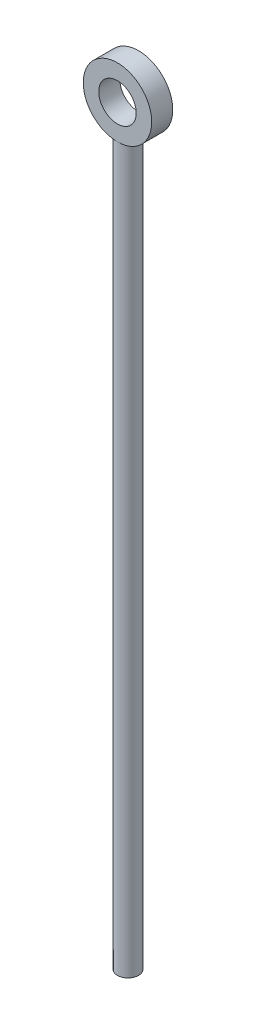
ISO-10303-21;
HEADER;
FILE_DESCRIPTION(('STEP AP214'),'2;1');
FILE_NAME('part.step','',(''),(''),'','','');
FILE_SCHEMA(('AUTOMOTIVE_DESIGN { 1 0 10303 214 1 1 1 1 }'));
ENDSEC;
DATA;
#1=APPLICATION_CONTEXT('core data for automotive mechanical design processes');
#2=APPLICATION_PROTOCOL_DEFINITION('international standard','automotive_design',2000,#1);
#3=PRODUCT_CONTEXT('',#1,'mechanical');
#4=PRODUCT('Part','Part','',(#3));
#5=PRODUCT_RELATED_PRODUCT_CATEGORY('part','',(#4));
#6=PRODUCT_DEFINITION_FORMATION('','',#4);
#7=PRODUCT_DEFINITION_CONTEXT('part definition',#1,'design');
#8=PRODUCT_DEFINITION('design','',#6,#7);
#9=PRODUCT_DEFINITION_SHAPE('','',#8);
#10=(LENGTH_UNIT() NAMED_UNIT(*) SI_UNIT(.MILLI.,.METRE.));
#11=(NAMED_UNIT(*) PLANE_ANGLE_UNIT() SI_UNIT($,.RADIAN.));
#12=(NAMED_UNIT(*) SI_UNIT($,.STERADIAN.) SOLID_ANGLE_UNIT());
#13=UNCERTAINTY_MEASURE_WITH_UNIT(LENGTH_MEASURE(1.E-05),#10,'distance_accuracy_value','');
#14=(GEOMETRIC_REPRESENTATION_CONTEXT(3) GLOBAL_UNCERTAINTY_ASSIGNED_CONTEXT((#13)) GLOBAL_UNIT_ASSIGNED_CONTEXT((#10,
#11,#12)) REPRESENTATION_CONTEXT('',''));
#15=CARTESIAN_POINT('',(0.,0.,0.));
#16=DIRECTION('',(0.,0.,1.));
#17=DIRECTION('',(1.,0.,0.));
#18=AXIS2_PLACEMENT_3D('',#15,#16,#17);
#19=CARTESIAN_POINT('',(0.,35.889766172627,0.5));
#20=DIRECTION('',(0.,0.,-1.));
#21=DIRECTION('',(-1.,0.,0.));
#22=AXIS2_PLACEMENT_3D('',#19,#20,#21);
#23=CYLINDRICAL_SURFACE('',#22,1.62420373642367);
#24=CARTESIAN_POINT('',(0.,35.889766172627,-0.5));
#25=DIRECTION('',(0.,0.,1.));
#26=DIRECTION('',(1.,0.,0.));
#27=AXIS2_PLACEMENT_3D('',#24,#25,#26);
#28=CIRCLE('',#27,1.62420373642367);
#29=CARTESIAN_POINT('',(0.,34.2655624362033,-0.5));
#30=VERTEX_POINT('',#29);
#31=EDGE_CURVE('E58',#30,#30,#28,.T.);
#32=ORIENTED_EDGE('',*,*,#31,.T.);
#33=CARTESIAN_POINT('',(0.,34.2655624362033,-0.5));
#34=CARTESIAN_POINT('',(-0.0273959650569291,34.2655626120081,-0.499999761655353));
#35=CARTESIAN_POINT('',(-0.0547943665766206,34.2662621552462,-0.49774094632123));
#36=CARTESIAN_POINT('',(-0.108791195346571,34.2689843095631,-0.488788203846725));
#37=CARTESIAN_POINT('',(-0.135389418168901,34.2710072557895,-0.482093153238379));
#38=CARTESIAN_POINT('',(-0.18699937598438,34.2761549722287,-0.464514192274198));
#39=CARTESIAN_POINT('',(-0.212013456476829,34.2792780663136,-0.453636651846705));
#40=CARTESIAN_POINT('',(-0.259862647884071,34.2863028088528,-0.428028217729409));
#41=CARTESIAN_POINT('',(-0.282697434582413,34.2902045728848,-0.413296751901816));
#42=CARTESIAN_POINT('',(-0.326226516506307,34.298502940221,-0.379932192439502));
#43=CARTESIAN_POINT('',(-0.346846066754933,34.3029100854535,-0.361204213427824));
#44=CARTESIAN_POINT('',(-0.384706943706058,34.3116607587948,-0.320580351485641));
#45=CARTESIAN_POINT('',(-0.401947664718296,34.3160042753685,-0.298683901794535));
#46=CARTESIAN_POINT('',(-0.432962251966401,34.324248419896,-0.251703105185421));
#47=CARTESIAN_POINT('',(-0.446643551918102,34.3281360029157,-0.226555144697881));
#48=CARTESIAN_POINT('',(-0.469551981823573,34.3348699339206,-0.174176366692686));
#49=CARTESIAN_POINT('',(-0.478780245777015,34.337716546952,-0.146946081503373));
#50=CARTESIAN_POINT('',(-0.492248642173422,34.3419361195404,-0.0920175365741991));
#51=CARTESIAN_POINT('',(-0.49662710808248,34.3433498437935,-0.0643564134990577));
#52=CARTESIAN_POINT('',(-0.500703715744717,34.3446646955963,-0.00865884561735611));
#53=CARTESIAN_POINT('',(-0.500403059783848,34.3445662117032,0.0193775009268592));
#54=CARTESIAN_POINT('',(-0.49523832653628,34.3429038111945,0.0738927251893176));
#55=CARTESIAN_POINT('',(-0.490549134430258,34.341396057566,0.100390170665931));
#56=CARTESIAN_POINT('',(-0.477023614675393,34.3371760998684,0.152202337601988));
#57=CARTESIAN_POINT('',(-0.468186858161657,34.3344637712459,0.177516936455464));
#58=CARTESIAN_POINT('',(-0.446491557013771,34.3280965639092,0.226665629927245));
#59=CARTESIAN_POINT('',(-0.433577419945774,34.3244287871017,0.250473442297051));
#60=CARTESIAN_POINT('',(-0.404132561828514,34.3165699680953,0.295641917887999));
#61=CARTESIAN_POINT('',(-0.387600924819578,34.3123787934864,0.317001959236749));
#62=CARTESIAN_POINT('',(-0.350528253964201,34.3037191787961,0.357658479659641));
#63=CARTESIAN_POINT('',(-0.329842558742949,34.2992466622683,0.376822417715332));
#64=CARTESIAN_POINT('',(-0.285495339239982,34.2906916052222,0.411441035267626));
#65=CARTESIAN_POINT('',(-0.261833607503864,34.2866090919254,0.426895455961495));
#66=CARTESIAN_POINT('',(-0.211956042210103,34.2792533109022,0.453742611845587));
#67=CARTESIAN_POINT('',(-0.185722667489932,34.2759862301156,0.465104567795669));
#68=CARTESIAN_POINT('',(-0.131593180735302,34.2706740541014,0.483215342783897));
#69=CARTESIAN_POINT('',(-0.103697560679008,34.268628599263,0.489965519478998));
#70=CARTESIAN_POINT('',(-0.0481611264333297,34.2660476368879,0.498437276302956));
#71=CARTESIAN_POINT('',(-0.0205501578275771,34.2654582555248,0.500338360496661));
#72=CARTESIAN_POINT('',(0.0345987792738432,34.2656969955516,0.499562952783861));
#73=CARTESIAN_POINT('',(0.0621367575340162,34.2665249166414,0.496887107711418));
#74=CARTESIAN_POINT('',(0.115671240160278,34.2694698830847,0.487178304376016));
#75=CARTESIAN_POINT('',(0.141688876762381,34.2715555202026,0.480251432364061));
#76=CARTESIAN_POINT('',(0.192186005718967,34.2767729205085,0.462365967705283));
#77=CARTESIAN_POINT('',(0.216665309452479,34.2799048116856,0.451406881777933));
#78=CARTESIAN_POINT('',(0.264041950201358,34.2869850098781,0.42547449129951));
#79=CARTESIAN_POINT('',(0.286887432673582,34.2909510554531,0.410411427344496));
#80=CARTESIAN_POINT('',(0.32978699627382,34.2992453465656,0.376806870767171));
#81=CARTESIAN_POINT('',(0.349840339315207,34.3035736873916,0.358264461428726));
#82=CARTESIAN_POINT('',(0.38738474371738,34.3123134730378,0.31738356305405));
#83=CARTESIAN_POINT('',(0.404747943048881,34.3167217326947,0.294926703969878));
#84=CARTESIAN_POINT('',(0.435469958476193,34.3249474881212,0.247322203786559));
#85=CARTESIAN_POINT('',(0.448828854943368,34.328764995747,0.222174616707436));
#86=CARTESIAN_POINT('',(0.47107657921468,34.3353339772515,0.16996567608207));
#87=CARTESIAN_POINT('',(0.47998414101333,34.3380899074812,0.142912899283405));
#88=CARTESIAN_POINT('',(0.493087555844141,34.3422034042809,0.0875897541892078));
#89=CARTESIAN_POINT('',(0.497285133739318,34.343561482749,0.0593198355691544));
#90=CARTESIAN_POINT('',(0.500728014967064,34.3446732558192,0.00369836398038735));
#91=CARTESIAN_POINT('',(0.500182569086245,34.3444947446877,-0.0236390451526099));
#92=CARTESIAN_POINT('',(0.494657894050206,34.3427175060786,-0.077812681866322));
#93=CARTESIAN_POINT('',(0.489678860421292,34.3411188412315,-0.10464893149546));
#94=CARTESIAN_POINT('',(0.475566568570856,34.3367280905848,-0.156696418197181));
#95=CARTESIAN_POINT('',(0.466491500840526,34.3339527536407,-0.18192495201224));
#96=CARTESIAN_POINT('',(0.444490356198478,34.3275252036852,-0.230521476369071));
#97=CARTESIAN_POINT('',(0.431563512896096,34.3238728161946,-0.25388909546956));
#98=CARTESIAN_POINT('',(0.401649241818577,34.3159289835023,-0.299064366363307));
#99=CARTESIAN_POINT('',(0.3845258229499,34.311618486466,-0.320778611065261));
#100=CARTESIAN_POINT('',(0.346945825330292,34.3029335528291,-0.361093244855917));
#101=CARTESIAN_POINT('',(0.326488365343228,34.298559099603,-0.379692808046));
#102=CARTESIAN_POINT('',(0.282049091401317,34.290074671351,-0.413832804202942));
#103=CARTESIAN_POINT('',(0.257976900133236,34.2859772857943,-0.42925906304052));
#104=CARTESIAN_POINT('',(0.207454651216072,34.2786639909578,-0.45582481525062));
#105=CARTESIAN_POINT('',(0.181005601788579,34.2754477102508,-0.466966115737671));
#106=CARTESIAN_POINT('',(0.129023406236828,34.27050464783,-0.483764690335307));
#107=CARTESIAN_POINT('',(0.103634040209841,34.2686671155373,-0.489835789226251));
#108=CARTESIAN_POINT('',(0.0521637647578095,34.2661960395187,-0.497953178152136));
#109=CARTESIAN_POINT('',(0.0260829866385801,34.2655622688242,-0.500000226921747));
#110=CARTESIAN_POINT('',(0.,34.2655624362033,-0.5));
#111=B_SPLINE_CURVE_WITH_KNOTS('',3,(#33,#34,#35,#36,#37,#38,#39,#40,#41,#42,#43,#44,#45,#46,
#47,#48,#49,#50,#51,#52,#53,#54,#55,#56,#57,#58,#59,#60,#61,#62,#63,#64,#65,#66,#67,#68,#69,#70,
#71,#72,#73,#74,#75,#76,#77,#78,#79,#80,#81,#82,#83,#84,#85,#86,#87,#88,#89,#90,#91,#92,#93,#94,
#95,#96,#97,#98,#99,#100,#101,#102,#103,#104,#105,#106,#107,#108,#109,#110),.UNSPECIFIED.,.T.,
.F.,(4,2,2,2,2,2,2,2,2,2,2,2,2,2,2,2,2,2,2,2,2,2,2,2,2,2,2,2,2,2,2,2,2,2,2,2,2,2,4),(0.,
0.0820920466723146,0.164204890945735,0.246193169627491,0.328193626863041,0.412415509050417,
0.496652475103623,0.582899963425087,0.669125476557771,0.752822573745136,0.836498165576304,
0.916975091944392,0.997460341591195,1.07909413649794,1.16074862524435,1.24600400868621,
1.33126533843187,1.4171551471742,1.50301965999629,1.58565619960796,1.66828106158401,
1.74892340123767,1.82957560954663,1.91215724319808,1.99476066557034,2.08053405675478,
2.16630572624475,2.25171330915919,2.3370896043849,2.41871908072577,2.50034495729131,
2.58084603278562,2.661363136347,2.74494918674335,2.82855736610092,2.91478647048752,
3.00097916910916,3.07915161498877,3.15730932003907),.UNSPECIFIED.);
#112=CARTESIAN_POINT('',(0.,34.2655624362033,0.5));
#113=VERTEX_POINT('',#112);
#114=EDGE_CURVE('E11',#30,#113,#111,.T.);
#115=ORIENTED_EDGE('',*,*,#114,.T.);
#116=CARTESIAN_POINT('',(0.,35.889766172627,0.5));
#117=DIRECTION('',(0.,0.,1.));
#118=DIRECTION('',(1.,0.,0.));
#119=AXIS2_PLACEMENT_3D('',#116,#117,#118);
#120=CIRCLE('',#119,1.62420373642367);
#121=EDGE_CURVE('E59',#113,#113,#120,.T.);
#122=ORIENTED_EDGE('',*,*,#121,.F.);
#123=EDGE_CURVE('E40',#113,#30,#111,.T.);
#124=ORIENTED_EDGE('',*,*,#123,.T.);
#125=EDGE_LOOP('',(#32,#115,#122,#124));
#126=FACE_BOUND('',#125,.T.);
#127=ADVANCED_FACE('F35',(#126),#23,.T.);
#128=CARTESIAN_POINT('',(0.,35.889766172627,0.5));
#129=DIRECTION('',(0.,0.,1.));
#130=DIRECTION('',(1.,0.,0.));
#131=AXIS2_PLACEMENT_3D('',#128,#129,#130);
#132=PLANE('',#131);
#133=ORIENTED_EDGE('',*,*,#121,.T.);
#134=EDGE_LOOP('',(#133));
#135=FACE_BOUND('',#134,.T.);
#136=CARTESIAN_POINT('',(0.,35.889766172627,0.5));
#137=DIRECTION('',(0.,0.,1.));
#138=DIRECTION('',(1.,0.,0.));
#139=AXIS2_PLACEMENT_3D('',#136,#137,#138);
#140=CIRCLE('',#139,0.889766172626996);
#141=CARTESIAN_POINT('',(0.889766172626996,35.889766172627,0.5));
#142=VERTEX_POINT('',#141);
#143=EDGE_CURVE('E66',#142,#142,#140,.T.);
#144=ORIENTED_EDGE('',*,*,#143,.F.);
#145=EDGE_LOOP('',(#144));
#146=FACE_BOUND('',#145,.T.);
#147=ADVANCED_FACE('F77',(#135,#146),#132,.T.);
#148=CARTESIAN_POINT('',(0.,35.889766172627,-0.5));
#149=DIRECTION('',(0.,0.,1.));
#150=DIRECTION('',(1.,0.,0.));
#151=AXIS2_PLACEMENT_3D('',#148,#149,#150);
#152=PLANE('',#151);
#153=ORIENTED_EDGE('',*,*,#31,.F.);
#154=EDGE_LOOP('',(#153));
#155=FACE_BOUND('',#154,.T.);
#156=CARTESIAN_POINT('',(0.,35.889766172627,-0.5));
#157=DIRECTION('',(0.,0.,1.));
#158=DIRECTION('',(1.,0.,0.));
#159=AXIS2_PLACEMENT_3D('',#156,#157,#158);
#160=CIRCLE('',#159,0.889766172626996);
#161=CARTESIAN_POINT('',(0.889766172626996,35.889766172627,-0.5));
#162=VERTEX_POINT('',#161);
#163=EDGE_CURVE('E68',#162,#162,#160,.T.);
#164=ORIENTED_EDGE('',*,*,#163,.T.);
#165=EDGE_LOOP('',(#164));
#166=FACE_BOUND('',#165,.T.);
#167=ADVANCED_FACE('F79',(#155,#166),#152,.F.);
#168=CARTESIAN_POINT('',(0.,35.889766172627,0.5));
#169=DIRECTION('',(0.,0.,-1.));
#170=DIRECTION('',(-1.,0.,0.));
#171=AXIS2_PLACEMENT_3D('',#168,#169,#170);
#172=CYLINDRICAL_SURFACE('',#171,0.889766172626996);
#173=ORIENTED_EDGE('',*,*,#143,.T.);
#174=EDGE_LOOP('',(#173));
#175=FACE_BOUND('',#174,.T.);
#176=ORIENTED_EDGE('',*,*,#163,.F.);
#177=EDGE_LOOP('',(#176));
#178=FACE_BOUND('',#177,.T.);
#179=ADVANCED_FACE('F74',(#175,#178),#172,.F.);
#180=CARTESIAN_POINT('',(0.,35.,0.));
#181=DIRECTION('',(0.,-1.,0.));
#182=DIRECTION('',(0.,0.,-1.));
#183=AXIS2_PLACEMENT_3D('',#180,#181,#182);
#184=CYLINDRICAL_SURFACE('',#183,0.5);
#185=CARTESIAN_POINT('',(0.,0.,0.));
#186=DIRECTION('',(0.,1.,0.));
#187=DIRECTION('',(0.,0.,1.));
#188=AXIS2_PLACEMENT_3D('',#185,#186,#187);
#189=CIRCLE('',#188,0.5);
#190=CARTESIAN_POINT('',(0.,0.,0.5));
#191=VERTEX_POINT('',#190);
#192=EDGE_CURVE('E60',#191,#191,#189,.T.);
#193=ORIENTED_EDGE('',*,*,#192,.T.);
#194=EDGE_LOOP('',(#193));
#195=FACE_BOUND('',#194,.T.);
#196=ORIENTED_EDGE('',*,*,#114,.F.);
#197=ORIENTED_EDGE('',*,*,#123,.F.);
#198=EDGE_LOOP('',(#196,#197));
#199=FACE_BOUND('',#198,.T.);
#200=ADVANCED_FACE('F37',(#195,#199),#184,.T.);
#201=CARTESIAN_POINT('',(0.,0.,0.));
#202=DIRECTION('',(0.,1.,0.));
#203=DIRECTION('',(0.,0.,1.));
#204=AXIS2_PLACEMENT_3D('',#201,#202,#203);
#205=PLANE('',#204);
#206=ORIENTED_EDGE('',*,*,#192,.F.);
#207=EDGE_LOOP('',(#206));
#208=FACE_BOUND('',#207,.T.);
#209=ADVANCED_FACE('F90',(#208),#205,.F.);
#210=CLOSED_SHELL('',(#127,#147,#167,#179,#200,#209));
#211=MANIFOLD_SOLID_BREP('B2',#210);
#212=ADVANCED_BREP_SHAPE_REPRESENTATION('',(#18,#211),#14);
#213=SHAPE_DEFINITION_REPRESENTATION(#9,#212);
ENDSEC;
END-ISO-10303-21;
